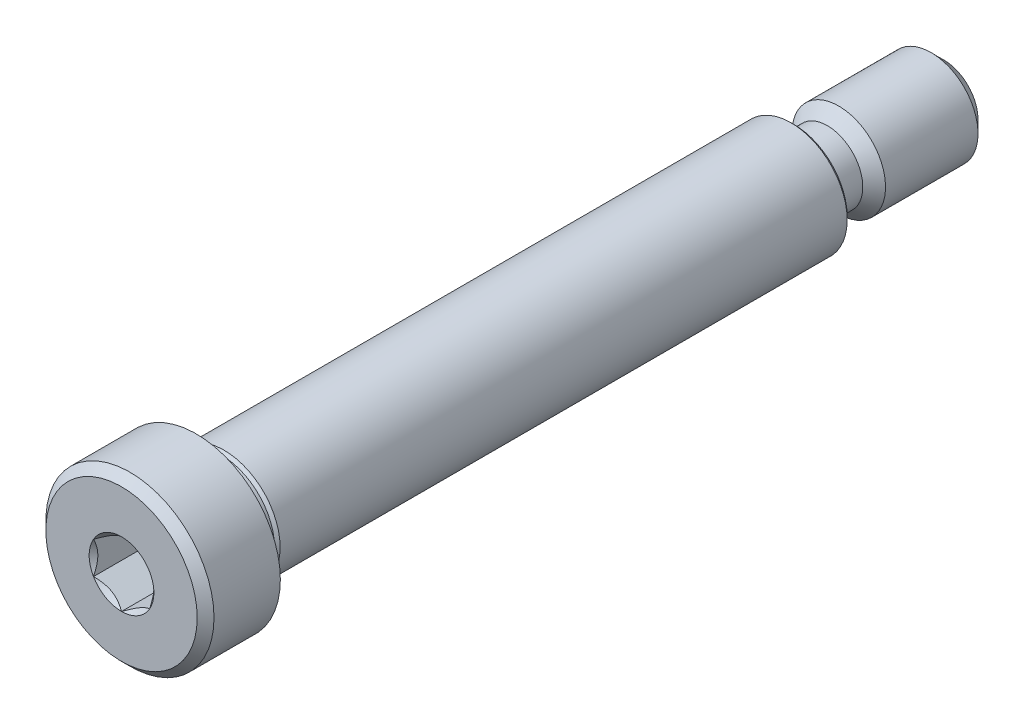
ISO-10303-21;
HEADER;
FILE_DESCRIPTION(('STEP AP214'),'2;1');
FILE_NAME('part.step','',(''),(''),'','','');
FILE_SCHEMA(('AUTOMOTIVE_DESIGN { 1 0 10303 214 1 1 1 1 }'));
ENDSEC;
DATA;
#1=APPLICATION_CONTEXT('core data for automotive mechanical design processes');
#2=APPLICATION_PROTOCOL_DEFINITION('international standard','automotive_design',2000,#1);
#3=PRODUCT_CONTEXT('',#1,'mechanical');
#4=PRODUCT('Part','Part','',(#3));
#5=PRODUCT_RELATED_PRODUCT_CATEGORY('part','',(#4));
#6=PRODUCT_DEFINITION_FORMATION('','',#4);
#7=PRODUCT_DEFINITION_CONTEXT('part definition',#1,'design');
#8=PRODUCT_DEFINITION('design','',#6,#7);
#9=PRODUCT_DEFINITION_SHAPE('','',#8);
#10=(LENGTH_UNIT() NAMED_UNIT(*) SI_UNIT(.MILLI.,.METRE.));
#11=(NAMED_UNIT(*) PLANE_ANGLE_UNIT() SI_UNIT($,.RADIAN.));
#12=(NAMED_UNIT(*) SI_UNIT($,.STERADIAN.) SOLID_ANGLE_UNIT());
#13=UNCERTAINTY_MEASURE_WITH_UNIT(LENGTH_MEASURE(1.E-05),#10,'distance_accuracy_value','');
#14=(GEOMETRIC_REPRESENTATION_CONTEXT(3) GLOBAL_UNCERTAINTY_ASSIGNED_CONTEXT((#13)) GLOBAL_UNIT_ASSIGNED_CONTEXT((#10,
#11,#12)) REPRESENTATION_CONTEXT('',''));
#15=CARTESIAN_POINT('',(0.,0.,0.));
#16=DIRECTION('',(0.,0.,1.));
#17=DIRECTION('',(1.,0.,0.));
#18=AXIS2_PLACEMENT_3D('',#15,#16,#17);
#19=CARTESIAN_POINT('',(0.,6.429375,34.925));
#20=DIRECTION('',(0.,0.,-1.));
#21=DIRECTION('',(-1.,0.,0.));
#22=AXIS2_PLACEMENT_3D('',#19,#20,#21);
#23=PLANE('',#22);
#24=CARTESIAN_POINT('',(0.,0.,34.925));
#25=DIRECTION('',(0.,0.,1.));
#26=DIRECTION('',(1.,0.,0.));
#27=AXIS2_PLACEMENT_3D('',#24,#25,#26);
#28=CIRCLE('',#27,2.74963065701559);
#29=CARTESIAN_POINT('',(-2.38125,1.3748153285078,34.925));
#30=VERTEX_POINT('',#29);
#31=CARTESIAN_POINT('',(-2.38125,-1.3748153285078,34.925));
#32=VERTEX_POINT('',#31);
#33=EDGE_CURVE('E135',#30,#32,#28,.T.);
#34=ORIENTED_EDGE('',*,*,#33,.F.);
#35=CARTESIAN_POINT('',(0.,2.74963065701559,34.925));
#36=VERTEX_POINT('',#35);
#37=EDGE_CURVE('E130',#36,#30,#28,.T.);
#38=ORIENTED_EDGE('',*,*,#37,.F.);
#39=CARTESIAN_POINT('',(2.38125,1.3748153285078,34.925));
#40=VERTEX_POINT('',#39);
#41=EDGE_CURVE('E102',#40,#36,#28,.T.);
#42=ORIENTED_EDGE('',*,*,#41,.F.);
#43=CARTESIAN_POINT('',(2.38125,-1.3748153285078,34.925));
#44=VERTEX_POINT('',#43);
#45=EDGE_CURVE('E92',#44,#40,#28,.T.);
#46=ORIENTED_EDGE('',*,*,#45,.F.);
#47=CARTESIAN_POINT('',(0.,-2.74963065701559,34.925));
#48=VERTEX_POINT('',#47);
#49=EDGE_CURVE('E53',#48,#44,#28,.T.);
#50=ORIENTED_EDGE('',*,*,#49,.F.);
#51=EDGE_CURVE('E60',#32,#48,#28,.T.);
#52=ORIENTED_EDGE('',*,*,#51,.F.);
#53=EDGE_LOOP('',(#34,#38,#42,#46,#50,#52));
#54=FACE_BOUND('',#53,.T.);
#55=CARTESIAN_POINT('',(0.,0.,34.925));
#56=DIRECTION('',(0.,0.,1.));
#57=DIRECTION('',(1.,0.,0.));
#58=AXIS2_PLACEMENT_3D('',#55,#56,#57);
#59=CIRCLE('',#58,6.429375);
#60=CARTESIAN_POINT('',(6.429375,0.,34.925));
#61=VERTEX_POINT('',#60);
#62=EDGE_CURVE('E47',#61,#61,#59,.T.);
#63=ORIENTED_EDGE('',*,*,#62,.T.);
#64=EDGE_LOOP('',(#63));
#65=FACE_BOUND('',#64,.T.);
#66=ADVANCED_FACE('F39',(#54,#65),#23,.F.);
#67=CARTESIAN_POINT('',(0.,0.,34.210625));
#68=DIRECTION('',(0.,0.,-1.));
#69=DIRECTION('',(-1.,0.,0.));
#70=AXIS2_PLACEMENT_3D('',#67,#68,#69);
#71=CONICAL_SURFACE('',#70,7.14375,0.785398163397446);
#72=ORIENTED_EDGE('',*,*,#62,.F.);
#73=EDGE_LOOP('',(#72));
#74=FACE_BOUND('',#73,.T.);
#75=CARTESIAN_POINT('',(0.,0.,34.210625));
#76=DIRECTION('',(0.,0.,1.));
#77=DIRECTION('',(1.,0.,0.));
#78=AXIS2_PLACEMENT_3D('',#75,#76,#77);
#79=CIRCLE('',#78,7.14375);
#80=CARTESIAN_POINT('',(7.14375,0.,34.210625));
#81=VERTEX_POINT('',#80);
#82=EDGE_CURVE('E304',#81,#81,#79,.T.);
#83=ORIENTED_EDGE('',*,*,#82,.T.);
#84=EDGE_LOOP('',(#83));
#85=FACE_BOUND('',#84,.T.);
#86=ADVANCED_FACE('F207',(#74,#85),#71,.T.);
#87=CARTESIAN_POINT('',(0.,0.,34.925));
#88=DIRECTION('',(0.,0.,1.));
#89=DIRECTION('',(1.,0.,0.));
#90=AXIS2_PLACEMENT_3D('',#87,#88,#89);
#91=CYLINDRICAL_SURFACE('',#90,7.14375);
#92=ORIENTED_EDGE('',*,*,#82,.F.);
#93=EDGE_LOOP('',(#92));
#94=FACE_BOUND('',#93,.T.);
#95=CARTESIAN_POINT('',(0.,0.,28.575));
#96=DIRECTION('',(0.,0.,1.));
#97=DIRECTION('',(1.,0.,0.));
#98=AXIS2_PLACEMENT_3D('',#95,#96,#97);
#99=CIRCLE('',#98,7.14375);
#100=CARTESIAN_POINT('',(7.14375,0.,28.575));
#101=VERTEX_POINT('',#100);
#102=EDGE_CURVE('E301',#101,#101,#99,.T.);
#103=ORIENTED_EDGE('',*,*,#102,.T.);
#104=EDGE_LOOP('',(#103));
#105=FACE_BOUND('',#104,.T.);
#106=ADVANCED_FACE('F211',(#94,#105),#91,.T.);
#107=CARTESIAN_POINT('',(0.,7.14375,28.575));
#108=DIRECTION('',(0.,0.,1.));
#109=DIRECTION('',(1.,0.,0.));
#110=AXIS2_PLACEMENT_3D('',#107,#108,#109);
#111=PLANE('',#110);
#112=ORIENTED_EDGE('',*,*,#102,.F.);
#113=EDGE_LOOP('',(#112));
#114=FACE_BOUND('',#113,.T.);
#115=CARTESIAN_POINT('',(0.,0.,28.575));
#116=DIRECTION('',(0.,0.,1.));
#117=DIRECTION('',(1.,0.,0.));
#118=AXIS2_PLACEMENT_3D('',#115,#116,#117);
#119=CIRCLE('',#118,4.7625);
#120=CARTESIAN_POINT('',(4.7625,0.,28.575));
#121=VERTEX_POINT('',#120);
#122=EDGE_CURVE('E298',#121,#121,#119,.T.);
#123=ORIENTED_EDGE('',*,*,#122,.T.);
#124=EDGE_LOOP('',(#123));
#125=FACE_BOUND('',#124,.T.);
#126=ADVANCED_FACE('F216',(#114,#125),#111,.F.);
#127=CARTESIAN_POINT('',(0.,0.,28.336875));
#128=DIRECTION('',(0.,0.,1.));
#129=DIRECTION('',(1.,0.,0.));
#130=AXIS2_PLACEMENT_3D('',#127,#128,#129);
#131=CONICAL_SURFACE('',#130,4.524375,0.785398163397454);
#132=ORIENTED_EDGE('',*,*,#122,.F.);
#133=EDGE_LOOP('',(#132));
#134=FACE_BOUND('',#133,.T.);
#135=CARTESIAN_POINT('',(0.,0.,28.336875));
#136=DIRECTION('',(0.,0.,1.));
#137=DIRECTION('',(1.,0.,0.));
#138=AXIS2_PLACEMENT_3D('',#135,#136,#137);
#139=CIRCLE('',#138,4.524375);
#140=CARTESIAN_POINT('',(4.524375,0.,28.336875));
#141=VERTEX_POINT('',#140);
#142=EDGE_CURVE('E295',#141,#141,#139,.T.);
#143=ORIENTED_EDGE('',*,*,#142,.T.);
#144=EDGE_LOOP('',(#143));
#145=FACE_BOUND('',#144,.T.);
#146=ADVANCED_FACE('F224',(#134,#145),#131,.T.);
#147=CARTESIAN_POINT('',(0.,0.,34.925));
#148=DIRECTION('',(0.,0.,1.));
#149=DIRECTION('',(1.,0.,0.));
#150=AXIS2_PLACEMENT_3D('',#147,#148,#149);
#151=CYLINDRICAL_SURFACE('',#150,4.524375);
#152=ORIENTED_EDGE('',*,*,#142,.F.);
#153=EDGE_LOOP('',(#152));
#154=FACE_BOUND('',#153,.T.);
#155=CARTESIAN_POINT('',(0.,0.,26.450925));
#156=DIRECTION('',(0.,0.,1.));
#157=DIRECTION('',(1.,0.,0.));
#158=AXIS2_PLACEMENT_3D('',#155,#156,#157);
#159=CIRCLE('',#158,4.524375);
#160=CARTESIAN_POINT('',(4.524375,0.,26.450925));
#161=VERTEX_POINT('',#160);
#162=EDGE_CURVE('E292',#161,#161,#159,.T.);
#163=ORIENTED_EDGE('',*,*,#162,.T.);
#164=EDGE_LOOP('',(#163));
#165=FACE_BOUND('',#164,.T.);
#166=ADVANCED_FACE('F228',(#154,#165),#151,.T.);
#167=CARTESIAN_POINT('',(0.,0.,26.2128));
#168=DIRECTION('',(0.,0.,-1.));
#169=DIRECTION('',(-1.,0.,0.));
#170=AXIS2_PLACEMENT_3D('',#167,#168,#169);
#171=CONICAL_SURFACE('',#170,4.7625,0.785398163397468);
#172=ORIENTED_EDGE('',*,*,#162,.F.);
#173=EDGE_LOOP('',(#172));
#174=FACE_BOUND('',#173,.T.);
#175=CARTESIAN_POINT('',(0.,0.,26.2128));
#176=DIRECTION('',(0.,0.,1.));
#177=DIRECTION('',(1.,0.,0.));
#178=AXIS2_PLACEMENT_3D('',#175,#176,#177);
#179=CIRCLE('',#178,4.7625);
#180=CARTESIAN_POINT('',(4.7625,0.,26.2128));
#181=VERTEX_POINT('',#180);
#182=EDGE_CURVE('E289',#181,#181,#179,.T.);
#183=ORIENTED_EDGE('',*,*,#182,.T.);
#184=EDGE_LOOP('',(#183));
#185=FACE_BOUND('',#184,.T.);
#186=ADVANCED_FACE('F232',(#174,#185),#171,.T.);
#187=CARTESIAN_POINT('',(0.,0.,34.925));
#188=DIRECTION('',(0.,0.,1.));
#189=DIRECTION('',(1.,0.,0.));
#190=AXIS2_PLACEMENT_3D('',#187,#188,#189);
#191=CYLINDRICAL_SURFACE('',#190,4.7625);
#192=ORIENTED_EDGE('',*,*,#182,.F.);
#193=EDGE_LOOP('',(#192));
#194=FACE_BOUND('',#193,.T.);
#195=CARTESIAN_POINT('',(0.,0.,-21.9625333333333));
#196=DIRECTION('',(0.,0.,1.));
#197=DIRECTION('',(1.,0.,0.));
#198=AXIS2_PLACEMENT_3D('',#195,#196,#197);
#199=CIRCLE('',#198,4.7625);
#200=CARTESIAN_POINT('',(4.7625,0.,-21.9625333333333));
#201=VERTEX_POINT('',#200);
#202=EDGE_CURVE('E286',#201,#201,#199,.T.);
#203=ORIENTED_EDGE('',*,*,#202,.T.);
#204=EDGE_LOOP('',(#203));
#205=FACE_BOUND('',#204,.T.);
#206=ADVANCED_FACE('F236',(#194,#205),#191,.T.);
#207=CARTESIAN_POINT('',(0.,0.,-22.225));
#208=DIRECTION('',(0.,0.,1.));
#209=DIRECTION('',(1.,0.,0.));
#210=AXIS2_PLACEMENT_3D('',#207,#208,#209);
#211=CONICAL_SURFACE('',#210,4.50003333333333,0.785398163397417);
#212=ORIENTED_EDGE('',*,*,#202,.F.);
#213=EDGE_LOOP('',(#212));
#214=FACE_BOUND('',#213,.T.);
#215=CARTESIAN_POINT('',(0.,0.,-22.225));
#216=DIRECTION('',(0.,0.,1.));
#217=DIRECTION('',(1.,0.,0.));
#218=AXIS2_PLACEMENT_3D('',#215,#216,#217);
#219=CIRCLE('',#218,4.50003333333333);
#220=CARTESIAN_POINT('',(4.50003333333333,0.,-22.225));
#221=VERTEX_POINT('',#220);
#222=EDGE_CURVE('E274',#221,#221,#219,.T.);
#223=ORIENTED_EDGE('',*,*,#222,.T.);
#224=EDGE_LOOP('',(#223));
#225=FACE_BOUND('',#224,.T.);
#226=ADVANCED_FACE('F240',(#214,#225),#211,.T.);
#227=CARTESIAN_POINT('',(0.,4.50003333333333,-22.225));
#228=DIRECTION('',(0.,0.,1.));
#229=DIRECTION('',(1.,0.,0.));
#230=AXIS2_PLACEMENT_3D('',#227,#228,#229);
#231=PLANE('',#230);
#232=CARTESIAN_POINT('',(0.,0.,-22.225));
#233=DIRECTION('',(0.,0.,-1.));
#234=DIRECTION('',(-1.,0.,0.));
#235=AXIS2_PLACEMENT_3D('',#232,#233,#234);
#236=CIRCLE('',#235,3.9751);
#237=CARTESIAN_POINT('',(-3.9751,0.,-22.225));
#238=VERTEX_POINT('',#237);
#239=EDGE_CURVE('E588',#238,#238,#236,.T.);
#240=ORIENTED_EDGE('',*,*,#239,.F.);
#241=EDGE_LOOP('',(#240));
#242=FACE_BOUND('',#241,.T.);
#243=ORIENTED_EDGE('',*,*,#222,.F.);
#244=EDGE_LOOP('',(#243));
#245=FACE_BOUND('',#244,.T.);
#246=ADVANCED_FACE('F244',(#242,#245),#231,.F.);
#247=CARTESIAN_POINT('',(0.,0.,34.925));
#248=DIRECTION('',(0.,0.,1.));
#249=DIRECTION('',(1.,0.,0.));
#250=AXIS2_PLACEMENT_3D('',#247,#248,#249);
#251=CONICAL_SURFACE('',#250,2.74963065701559,0.78539816339745);
#252=ORIENTED_EDGE('',*,*,#41,.T.);
#253=CARTESIAN_POINT('',(2.38145,1.37469985845396,34.9251154773272));
#254=CARTESIAN_POINT('',(2.29959321762095,1.4219598937955,34.8778948967095));
#255=CARTESIAN_POINT('',(2.21636766622824,1.47001018829554,34.8334475752929));
#256=CARTESIAN_POINT('',(2.04666151916196,1.56799007798739,34.7520654569856));
#257=CARTESIAN_POINT('',(1.9601647826469,1.61792899209839,34.7151759430951));
#258=CARTESIAN_POINT('',(1.78574822599096,1.71862843803482,34.6519834131659));
#259=CARTESIAN_POINT('',(1.69787282881932,1.76936332224701,34.6255215587295));
#260=CARTESIAN_POINT('',(1.52018740592912,1.87195004898374,34.5847515156161));
#261=CARTESIAN_POINT('',(1.43038280881413,1.92379875730254,34.5704128915305));
#262=CARTESIAN_POINT('',(1.27561039686966,2.01315665100181,34.5574757847701));
#263=CARTESIAN_POINT('',(1.21084255103038,2.05055038423195,34.5555606046532));
#264=CARTESIAN_POINT('',(1.08141272066442,2.1252767316349,34.5587866227677));
#265=CARTESIAN_POINT('',(1.01675078120664,2.16260931978718,34.5639302948571));
#266=CARTESIAN_POINT('',(0.888037451422602,2.23692199538629,34.5809813108716));
#267=CARTESIAN_POINT('',(0.823986825765144,2.27390164135138,34.5928962213493));
#268=CARTESIAN_POINT('',(0.696993161094725,2.34722146783423,34.622835672352));
#269=CARTESIAN_POINT('',(0.634050037564174,2.38356169714823,34.6408597445185));
#270=CARTESIAN_POINT('',(0.472823849267817,2.47664568036155,34.6943688075524));
#271=CARTESIAN_POINT('',(0.375540508712158,2.53281224321902,34.7338874208722));
#272=CARTESIAN_POINT('',(0.232493937374429,2.61540021968751,34.8006003435508));
#273=CARTESIAN_POINT('',(0.185353711056035,2.6426166420421,34.8240402091113));
#274=CARTESIAN_POINT('',(0.091946473633363,2.69654533571234,34.8730566766595));
#275=CARTESIAN_POINT('',(0.0456789475031802,2.72325790437833,34.8986319667669));
#276=CARTESIAN_POINT('',(-0.000199999999998552,2.74974612706943,34.9251154773272));
#277=B_SPLINE_CURVE_WITH_KNOTS('',3,(#253,#254,#255,#256,#257,#258,#259,#260,#261,#262,#263,
#264,#265,#266,#267,#268,#269,#270,#271,#272,#273,#274,#275,#276),.UNSPECIFIED.,.F.,.F.,(4,2,2,
2,2,2,2,2,2,2,2,4),(0.,0.317196610611951,0.636241461041219,0.950218950629223,1.26340583824126,
1.48752413747844,1.71172100167747,1.93616888974082,2.16059957440836,2.51709639744763,
2.69486147369099,2.87251813383153),.UNSPECIFIED.);
#278=EDGE_CURVE('E11',#40,#36,#277,.T.);
#279=ORIENTED_EDGE('',*,*,#278,.F.);
#280=EDGE_LOOP('',(#252,#279));
#281=FACE_BOUND('',#280,.T.);
#282=ADVANCED_FACE('F105',(#281),#251,.F.);
#283=ORIENTED_EDGE('',*,*,#37,.T.);
#284=CARTESIAN_POINT('',(0.000199999999999747,2.74974612706943,34.9251154773272));
#285=CARTESIAN_POINT('',(-0.08165678237905,2.70248609172789,34.8778948967095));
#286=CARTESIAN_POINT('',(-0.16488233377176,2.65443579722785,34.8334475752929));
#287=CARTESIAN_POINT('',(-0.33458848083804,2.556455907536,34.7520654569856));
#288=CARTESIAN_POINT('',(-0.421085217353103,2.50651699342501,34.7151759430951));
#289=CARTESIAN_POINT('',(-0.595501774009043,2.40581754748857,34.6519834131659));
#290=CARTESIAN_POINT('',(-0.683377171180675,2.35508266327639,34.6255215587295));
#291=CARTESIAN_POINT('',(-0.861062594070875,2.25249593653966,34.5847515156161));
#292=CARTESIAN_POINT('',(-0.95086719118587,2.20064722822085,34.5704128915305));
#293=CARTESIAN_POINT('',(-1.10563960313034,2.11128933452158,34.5574757847701));
#294=CARTESIAN_POINT('',(-1.17040744896962,2.07389560129144,34.5555606046532));
#295=CARTESIAN_POINT('',(-1.29983727933557,1.99916925388849,34.5587866227677));
#296=CARTESIAN_POINT('',(-1.36449921879335,1.96183666573622,34.5639302948571));
#297=CARTESIAN_POINT('',(-1.49321254857739,1.88752399013711,34.5809813108716));
#298=CARTESIAN_POINT('',(-1.55726317423485,1.85054434417201,34.5928962213493));
#299=CARTESIAN_POINT('',(-1.68425683890527,1.77722451768917,34.622835672352));
#300=CARTESIAN_POINT('',(-1.74719996243582,1.74088428837517,34.6408597445185));
#301=CARTESIAN_POINT('',(-1.90842615073218,1.64780030516185,34.6943688075524));
#302=CARTESIAN_POINT('',(-2.00570949128784,1.59163374230437,34.7338874208722));
#303=CARTESIAN_POINT('',(-2.14875606262557,1.50904576583588,34.8006003435508));
#304=CARTESIAN_POINT('',(-2.19589628894397,1.48182934348129,34.8240402091113));
#305=CARTESIAN_POINT('',(-2.28930352636664,1.42790064981105,34.8730566766595));
#306=CARTESIAN_POINT('',(-2.33557105249682,1.40118808114505,34.8986319667669));
#307=CARTESIAN_POINT('',(-2.38145,1.37469985845396,34.9251154773272));
#308=B_SPLINE_CURVE_WITH_KNOTS('',3,(#284,#285,#286,#287,#288,#289,#290,#291,#292,#293,#294,
#295,#296,#297,#298,#299,#300,#301,#302,#303,#304,#305,#306,#307),.UNSPECIFIED.,.F.,.F.,(4,2,2,
2,2,2,2,2,2,2,2,4),(0.,0.317196610611948,0.636241461041218,0.950218950629222,1.26340583824126,
1.48752413747844,1.71172100167747,1.93616888974082,2.16059957440836,2.51709639744763,
2.69486147369099,2.87251813383154),.UNSPECIFIED.);
#309=EDGE_CURVE('E131',#36,#30,#308,.T.);
#310=ORIENTED_EDGE('',*,*,#309,.F.);
#311=EDGE_LOOP('',(#283,#310));
#312=FACE_BOUND('',#311,.T.);
#313=ADVANCED_FACE('F337',(#312),#251,.F.);
#314=ORIENTED_EDGE('',*,*,#33,.T.);
#315=CARTESIAN_POINT('',(-2.38125,-2.74194290589387,35.8069808945799));
#316=CARTESIAN_POINT('',(-2.38125,-2.67517961056039,35.7565846679781));
#317=CARTESIAN_POINT('',(-2.38125,-2.60804251112752,35.7066755875907));
#318=CARTESIAN_POINT('',(-2.38125,-2.47287325055307,35.6080498309857));
#319=CARTESIAN_POINT('',(-2.38125,-2.40484086895313,35.5593334572448));
#320=CARTESIAN_POINT('',(-2.38125,-2.26723593505441,35.4629648544534));
#321=CARTESIAN_POINT('',(-2.38125,-2.19765553346049,35.4153237954326));
#322=CARTESIAN_POINT('',(-2.38125,-2.05731367842203,35.3218199233866));
#323=CARTESIAN_POINT('',(-2.38125,-1.98655230892573,35.2759569847287));
#324=CARTESIAN_POINT('',(-2.38125,-1.83957751909226,35.1838459007133));
#325=CARTESIAN_POINT('',(-2.38125,-1.76328361992075,35.1377255173928));
#326=CARTESIAN_POINT('',(-2.38125,-1.6089135770446,35.0485183038905));
#327=CARTESIAN_POINT('',(-2.38125,-1.53083712149137,35.0054320099754));
#328=CARTESIAN_POINT('',(-2.38125,-1.37291620334514,34.9232265014712));
#329=CARTESIAN_POINT('',(-2.38125,-1.29307799938228,34.8840953578519));
#330=CARTESIAN_POINT('',(-2.38125,-1.13121425093132,34.8106679503152));
#331=CARTESIAN_POINT('',(-2.38125,-1.04918943681795,34.7763700954538));
#332=CARTESIAN_POINT('',(-2.38125,-0.889535256759271,34.7163546314156));
#333=CARTESIAN_POINT('',(-2.38125,-0.812083865770258,34.690168478432));
#334=CARTESIAN_POINT('',(-2.38125,-0.655316366527662,34.6440097514868));
#335=CARTESIAN_POINT('',(-2.38125,-0.57600013021683,34.6240376055837));
#336=CARTESIAN_POINT('',(-2.38125,-0.417295761573375,34.5916821452488));
#337=CARTESIAN_POINT('',(-2.38125,-0.337934576883846,34.5791688083547));
#338=CARTESIAN_POINT('',(-2.38125,-0.178363852969583,34.5619738601659));
#339=CARTESIAN_POINT('',(-2.38125,-0.0981544619617662,34.5572909026126));
#340=CARTESIAN_POINT('',(-2.38125,0.0594188034321302,34.5561044408392));
#341=CARTESIAN_POINT('',(-2.38125,0.136780588525994,34.5593110105046));
#342=CARTESIAN_POINT('',(-2.38125,0.29084096060734,34.5730870567428));
#343=CARTESIAN_POINT('',(-2.38125,0.36753948243541,34.5836572485871));
#344=CARTESIAN_POINT('',(-2.38125,0.521017492835389,34.6117628298525));
#345=CARTESIAN_POINT('',(-2.38125,0.597774958394049,34.6294167489314));
#346=CARTESIAN_POINT('',(-2.38125,0.74960981425701,34.6707513962434));
#347=CARTESIAN_POINT('',(-2.38125,0.824687344568028,34.6944316201904));
#348=CARTESIAN_POINT('',(-2.38125,1.06107814410025,34.777894862956));
#349=CARTESIAN_POINT('',(-2.38125,1.2190478622181,34.8471839270396));
#350=CARTESIAN_POINT('',(-2.38125,1.45021000267342,34.9626640838597));
#351=CARTESIAN_POINT('',(-2.38125,1.52644290442585,35.0031730572583));
#352=CARTESIAN_POINT('',(-2.38125,1.67717618538172,35.0873026892371));
#353=CARTESIAN_POINT('',(-2.38125,1.7516768735884,35.1309227870999));
#354=CARTESIAN_POINT('',(-2.38125,1.89548152088328,35.218412556489));
#355=CARTESIAN_POINT('',(-2.38125,1.96485959608998,35.2621617927418));
#356=CARTESIAN_POINT('',(-2.38125,2.10242624411169,35.3515011587306));
#357=CARTESIAN_POINT('',(-2.38125,2.17061472626633,35.397091427904));
#358=CARTESIAN_POINT('',(-2.38125,2.30540317317354,35.4894060050932));
#359=CARTESIAN_POINT('',(-2.38125,2.37201154222166,35.5361180928962));
#360=CARTESIAN_POINT('',(-2.38125,2.50431800054459,35.6307775780183));
#361=CARTESIAN_POINT('',(-2.38125,2.57001633510792,35.6787246320963));
#362=CARTESIAN_POINT('',(-2.38125,2.63533378855947,35.7271767335425));
#363=B_SPLINE_CURVE_WITH_KNOTS('',3,(#315,#316,#317,#318,#319,#320,#321,#322,#323,#324,#325,
#326,#327,#328,#329,#330,#331,#332,#333,#334,#335,#336,#337,#338,#339,#340,#341,#342,#343,#344,
#345,#346,#347,#348,#349,#350,#351,#352,#353,#354,#355,#356,#357,#358,#359,#360,#361,#362),
.UNSPECIFIED.,.F.,.F.,(4,2,2,2,2,2,2,2,2,2,2,2,2,2,2,2,2,2,2,2,2,2,2,4),(0.,0.250951284009982,
0.50196556482788,0.754924775973582,1.00786608164542,1.27526207798892,1.54270521780082,
1.80931602029339,2.07583885812519,2.32089852590464,2.56597507114535,2.80664400307698,
3.04727155311265,3.27918940971451,3.51112979698762,3.74712477407482,3.98310000940112,
4.49898139184705,4.75794323931354,5.01685853149448,5.26288960015361,5.50893933794672,
5.75299038397142,5.9969743162797),.UNSPECIFIED.);
#364=EDGE_CURVE('E133',#30,#32,#363,.F.);
#365=ORIENTED_EDGE('',*,*,#364,.F.);
#366=EDGE_LOOP('',(#314,#365));
#367=FACE_BOUND('',#366,.T.);
#368=ADVANCED_FACE('F330',(#367),#251,.F.);
#369=ORIENTED_EDGE('',*,*,#51,.T.);
#370=CARTESIAN_POINT('',(-2.38145,-1.37469985845396,34.9251154773272));
#371=CARTESIAN_POINT('',(-2.29959321762095,-1.4219598937955,34.8778948967095));
#372=CARTESIAN_POINT('',(-2.21636766622824,-1.47001018829554,34.8334475752929));
#373=CARTESIAN_POINT('',(-2.04666151916196,-1.56799007798739,34.7520654569856));
#374=CARTESIAN_POINT('',(-1.9601647826469,-1.61792899209838,34.7151759430951));
#375=CARTESIAN_POINT('',(-1.78574822599096,-1.71862843803482,34.6519834131659));
#376=CARTESIAN_POINT('',(-1.69787282881933,-1.769363322247,34.6255215587295));
#377=CARTESIAN_POINT('',(-1.52018740592913,-1.87195004898373,34.5847515156161));
#378=CARTESIAN_POINT('',(-1.43038280881413,-1.92379875730254,34.5704128915305));
#379=CARTESIAN_POINT('',(-1.27561039686966,-2.01315665100181,34.5574757847701));
#380=CARTESIAN_POINT('',(-1.21084255103039,-2.05055038423195,34.5555606046532));
#381=CARTESIAN_POINT('',(-1.08141272066443,-2.1252767316349,34.5587866227677));
#382=CARTESIAN_POINT('',(-1.01675078120665,-2.16260931978717,34.5639302948571));
#383=CARTESIAN_POINT('',(-0.888037451422606,-2.23692199538628,34.5809813108716));
#384=CARTESIAN_POINT('',(-0.823986825765148,-2.27390164135138,34.5928962213493));
#385=CARTESIAN_POINT('',(-0.696993161094729,-2.34722146783422,34.622835672352));
#386=CARTESIAN_POINT('',(-0.634050037564179,-2.38356169714822,34.6408597445185));
#387=CARTESIAN_POINT('',(-0.472823849267822,-2.47664568036154,34.6943688075524));
#388=CARTESIAN_POINT('',(-0.375540508712162,-2.53281224321902,34.7338874208722));
#389=CARTESIAN_POINT('',(-0.232493937374432,-2.61540021968751,34.8006003435508));
#390=CARTESIAN_POINT('',(-0.185353711056037,-2.64261664204209,34.8240402091113));
#391=CARTESIAN_POINT('',(-0.0919464736333625,-2.69654533571233,34.8730566766595));
#392=CARTESIAN_POINT('',(-0.0456789475031788,-2.72325790437833,34.8986319667669));
#393=CARTESIAN_POINT('',(0.00020000000000081,-2.74974612706943,34.9251154773272));
#394=B_SPLINE_CURVE_WITH_KNOTS('',3,(#370,#371,#372,#373,#374,#375,#376,#377,#378,#379,#380,
#381,#382,#383,#384,#385,#386,#387,#388,#389,#390,#391,#392,#393),.UNSPECIFIED.,.F.,.F.,(4,2,2,
2,2,2,2,2,2,2,2,4),(0.,0.31719661061195,0.636241461041217,0.95021895062922,1.26340583824126,
1.48752413747844,1.71172100167747,1.93616888974082,2.16059957440836,2.51709639744763,
2.69486147369099,2.87251813383154),.UNSPECIFIED.);
#395=EDGE_CURVE('E173',#32,#48,#394,.T.);
#396=ORIENTED_EDGE('',*,*,#395,.F.);
#397=EDGE_LOOP('',(#369,#396));
#398=FACE_BOUND('',#397,.T.);
#399=ADVANCED_FACE('F331',(#398),#251,.F.);
#400=ORIENTED_EDGE('',*,*,#49,.T.);
#401=CARTESIAN_POINT('',(-0.000200000000000139,-2.74974612706943,34.9251154773272));
#402=CARTESIAN_POINT('',(0.0816567823790498,-2.70248609172789,34.8778948967095));
#403=CARTESIAN_POINT('',(0.16488233377176,-2.65443579722785,34.8334475752929));
#404=CARTESIAN_POINT('',(0.334588480838041,-2.556455907536,34.7520654569856));
#405=CARTESIAN_POINT('',(0.421085217353104,-2.50651699342501,34.7151759430951));
#406=CARTESIAN_POINT('',(0.595501774009045,-2.40581754748857,34.6519834131659));
#407=CARTESIAN_POINT('',(0.683377171180677,-2.35508266327638,34.6255215587295));
#408=CARTESIAN_POINT('',(0.861062594070879,-2.25249593653965,34.5847515156161));
#409=CARTESIAN_POINT('',(0.950867191185875,-2.20064722822084,34.5704128915305));
#410=CARTESIAN_POINT('',(1.10563960313035,-2.11128933452158,34.5574757847701));
#411=CARTESIAN_POINT('',(1.17040744896962,-2.07389560129144,34.5555606046532));
#412=CARTESIAN_POINT('',(1.29983727933558,-1.99916925388849,34.5587866227677));
#413=CARTESIAN_POINT('',(1.36449921879336,-1.96183666573621,34.5639302948571));
#414=CARTESIAN_POINT('',(1.4932125485774,-1.8875239901371,34.5809813108716));
#415=CARTESIAN_POINT('',(1.55726317423486,-1.85054434417201,34.5928962213493));
#416=CARTESIAN_POINT('',(1.68425683890528,-1.77722451768916,34.622835672352));
#417=CARTESIAN_POINT('',(1.74719996243583,-1.74088428837516,34.6408597445185));
#418=CARTESIAN_POINT('',(1.90842615073219,-1.64780030516185,34.6943688075524));
#419=CARTESIAN_POINT('',(2.00570949128784,-1.59163374230437,34.7338874208722));
#420=CARTESIAN_POINT('',(2.14875606262557,-1.50904576583588,34.8006003435508));
#421=CARTESIAN_POINT('',(2.19589628894397,-1.48182934348129,34.8240402091113));
#422=CARTESIAN_POINT('',(2.28930352636664,-1.42790064981105,34.8730566766595));
#423=CARTESIAN_POINT('',(2.33557105249682,-1.40118808114506,34.8986319667669));
#424=CARTESIAN_POINT('',(2.38145,-1.37469985845396,34.9251154773272));
#425=B_SPLINE_CURVE_WITH_KNOTS('',3,(#401,#402,#403,#404,#405,#406,#407,#408,#409,#410,#411,
#412,#413,#414,#415,#416,#417,#418,#419,#420,#421,#422,#423,#424),.UNSPECIFIED.,.F.,.F.,(4,2,2,
2,2,2,2,2,2,2,2,4),(0.,0.317196610611949,0.63624146104122,0.950218950629226,1.26340583824126,
1.48752413747844,1.71172100167747,1.93616888974082,2.16059957440837,2.51709639744763,
2.69486147369099,2.87251813383154),.UNSPECIFIED.);
#426=EDGE_CURVE('E117',#48,#44,#425,.T.);
#427=ORIENTED_EDGE('',*,*,#426,.F.);
#428=EDGE_LOOP('',(#400,#427));
#429=FACE_BOUND('',#428,.T.);
#430=ADVANCED_FACE('F159',(#429),#251,.F.);
#431=ORIENTED_EDGE('',*,*,#45,.T.);
#432=CARTESIAN_POINT('',(2.38125,-2.74194290589387,35.8069808945799));
#433=CARTESIAN_POINT('',(2.38125,-2.6751796105604,35.7565846679781));
#434=CARTESIAN_POINT('',(2.38125,-2.60804251112752,35.7066755875907));
#435=CARTESIAN_POINT('',(2.38125,-2.47287325055307,35.6080498309857));
#436=CARTESIAN_POINT('',(2.38125,-2.40484086895312,35.5593334572448));
#437=CARTESIAN_POINT('',(2.38125,-2.26723593505441,35.4629648544534));
#438=CARTESIAN_POINT('',(2.38125,-2.19765553346049,35.4153237954326));
#439=CARTESIAN_POINT('',(2.38125,-2.05731367842203,35.3218199233866));
#440=CARTESIAN_POINT('',(2.38125,-1.98655230892573,35.2759569847287));
#441=CARTESIAN_POINT('',(2.38125,-1.83957751909225,35.1838459007133));
#442=CARTESIAN_POINT('',(2.38125,-1.76328361992075,35.1377255173928));
#443=CARTESIAN_POINT('',(2.38125,-1.60891357704459,35.0485183038905));
#444=CARTESIAN_POINT('',(2.38125,-1.53083712149136,35.0054320099754));
#445=CARTESIAN_POINT('',(2.38125,-1.37291620334514,34.9232265014712));
#446=CARTESIAN_POINT('',(2.38125,-1.29307799938228,34.8840953578519));
#447=CARTESIAN_POINT('',(2.38125,-1.13121425093132,34.8106679503151));
#448=CARTESIAN_POINT('',(2.38125,-1.04918943681795,34.7763700954537));
#449=CARTESIAN_POINT('',(2.38125,-0.889535256759271,34.7163546314156));
#450=CARTESIAN_POINT('',(2.38125,-0.812083865770258,34.690168478432));
#451=CARTESIAN_POINT('',(2.38125,-0.655316366527662,34.6440097514868));
#452=CARTESIAN_POINT('',(2.38125,-0.576000130216831,34.6240376055837));
#453=CARTESIAN_POINT('',(2.38125,-0.417295761573376,34.5916821452488));
#454=CARTESIAN_POINT('',(2.38125,-0.337934576883848,34.5791688083547));
#455=CARTESIAN_POINT('',(2.38125,-0.178363852969584,34.5619738601659));
#456=CARTESIAN_POINT('',(2.38125,-0.0981544619617677,34.5572909026126));
#457=CARTESIAN_POINT('',(2.38125,0.0594188034321287,34.5561044408392));
#458=CARTESIAN_POINT('',(2.38125,0.136780588525993,34.5593110105046));
#459=CARTESIAN_POINT('',(2.38125,0.290840960607339,34.5730870567428));
#460=CARTESIAN_POINT('',(2.38125,0.367539482435409,34.5836572485871));
#461=CARTESIAN_POINT('',(2.38125,0.521017492835389,34.6117628298525));
#462=CARTESIAN_POINT('',(2.38125,0.597774958394049,34.6294167489314));
#463=CARTESIAN_POINT('',(2.38125,0.74960981425701,34.6707513962434));
#464=CARTESIAN_POINT('',(2.38125,0.824687344568027,34.6944316201904));
#465=CARTESIAN_POINT('',(2.38125,1.06107814410025,34.777894862956));
#466=CARTESIAN_POINT('',(2.38125,1.2190478622181,34.8471839270396));
#467=CARTESIAN_POINT('',(2.38125,1.45021000267342,34.9626640838597));
#468=CARTESIAN_POINT('',(2.38125,1.52644290442585,35.0031730572583));
#469=CARTESIAN_POINT('',(2.38125,1.67717618538173,35.0873026892371));
#470=CARTESIAN_POINT('',(2.38125,1.7516768735884,35.1309227870999));
#471=CARTESIAN_POINT('',(2.38125,1.89548152088328,35.218412556489));
#472=CARTESIAN_POINT('',(2.38125,1.96485959608998,35.2621617927418));
#473=CARTESIAN_POINT('',(2.38125,2.10242624411169,35.3515011587306));
#474=CARTESIAN_POINT('',(2.38125,2.17061472626633,35.397091427904));
#475=CARTESIAN_POINT('',(2.38125,2.30540317317354,35.4894060050932));
#476=CARTESIAN_POINT('',(2.38125,2.37201154222167,35.5361180928962));
#477=CARTESIAN_POINT('',(2.38125,2.50431800054459,35.6307775780183));
#478=CARTESIAN_POINT('',(2.38125,2.57001633510792,35.6787246320963));
#479=CARTESIAN_POINT('',(2.38125,2.63533378855947,35.7271767335425));
#480=B_SPLINE_CURVE_WITH_KNOTS('',3,(#432,#433,#434,#435,#436,#437,#438,#439,#440,#441,#442,
#443,#444,#445,#446,#447,#448,#449,#450,#451,#452,#453,#454,#455,#456,#457,#458,#459,#460,#461,
#462,#463,#464,#465,#466,#467,#468,#469,#470,#471,#472,#473,#474,#475,#476,#477,#478,#479),
.UNSPECIFIED.,.F.,.F.,(4,2,2,2,2,2,2,2,2,2,2,2,2,2,2,2,2,2,2,2,2,2,2,4),(0.,0.250951284009989,
0.501965564827885,0.754924775973593,1.00786608164543,1.27526207798892,1.54270521780083,
1.8093160202934,2.0758388581252,2.32089852590464,2.56597507114536,2.80664400307698,
3.04727155311265,3.27918940971451,3.51112979698762,3.74712477407483,3.98310000940112,
4.49898139184705,4.75794323931354,5.01685853149448,5.26288960015361,5.50893933794672,
5.75299038397142,5.99697431627971),.UNSPECIFIED.);
#481=EDGE_CURVE('E96',#44,#40,#480,.T.);
#482=ORIENTED_EDGE('',*,*,#481,.F.);
#483=EDGE_LOOP('',(#431,#482));
#484=FACE_BOUND('',#483,.T.);
#485=ADVANCED_FACE('F94',(#484),#251,.F.);
#486=CARTESIAN_POINT('',(0.,0.,30.1625));
#487=DIRECTION('',(0.,0.,1.));
#488=DIRECTION('',(1.,0.,0.));
#489=AXIS2_PLACEMENT_3D('',#486,#487,#488);
#490=PLANE('',#489);
#491=DIRECTION('',(0.,1.,0.));
#492=VECTOR('',#491,1.);
#493=CARTESIAN_POINT('',(2.38125,-1.3748153285078,30.1625));
#494=LINE('',#493,#492);
#495=CARTESIAN_POINT('',(2.38125,-1.3748153285078,30.1625));
#496=VERTEX_POINT('',#495);
#497=CARTESIAN_POINT('',(2.38125,1.3748153285078,30.1625));
#498=VERTEX_POINT('',#497);
#499=EDGE_CURVE('E116',#496,#498,#494,.T.);
#500=ORIENTED_EDGE('',*,*,#499,.T.);
#501=DIRECTION('',(-0.866025403784439,0.5,0.));
#502=VECTOR('',#501,1.);
#503=CARTESIAN_POINT('',(2.38125,1.3748153285078,30.1625));
#504=LINE('',#503,#502);
#505=CARTESIAN_POINT('',(0.,2.74963065701559,30.1625));
#506=VERTEX_POINT('',#505);
#507=EDGE_CURVE('E121',#498,#506,#504,.T.);
#508=ORIENTED_EDGE('',*,*,#507,.T.);
#509=DIRECTION('',(-0.866025403784439,-0.5,0.));
#510=VECTOR('',#509,1.);
#511=CARTESIAN_POINT('',(0.,2.74963065701559,30.1625));
#512=LINE('',#511,#510);
#513=CARTESIAN_POINT('',(-2.38125,1.3748153285078,30.1625));
#514=VERTEX_POINT('',#513);
#515=EDGE_CURVE('E263',#506,#514,#512,.T.);
#516=ORIENTED_EDGE('',*,*,#515,.T.);
#517=DIRECTION('',(0.,-1.,0.));
#518=VECTOR('',#517,1.);
#519=CARTESIAN_POINT('',(-2.38125,1.3748153285078,30.1625));
#520=LINE('',#519,#518);
#521=CARTESIAN_POINT('',(-2.38125,-1.3748153285078,30.1625));
#522=VERTEX_POINT('',#521);
#523=EDGE_CURVE('E267',#514,#522,#520,.T.);
#524=ORIENTED_EDGE('',*,*,#523,.T.);
#525=DIRECTION('',(0.866025403784439,-0.5,0.));
#526=VECTOR('',#525,1.);
#527=CARTESIAN_POINT('',(-2.38125,-1.3748153285078,30.1625));
#528=LINE('',#527,#526);
#529=CARTESIAN_POINT('',(0.,-2.74963065701559,30.1625));
#530=VERTEX_POINT('',#529);
#531=EDGE_CURVE('E270',#522,#530,#528,.T.);
#532=ORIENTED_EDGE('',*,*,#531,.T.);
#533=DIRECTION('',(0.866025403784439,0.5,0.));
#534=VECTOR('',#533,1.);
#535=CARTESIAN_POINT('',(0.,-2.74963065701559,30.1625));
#536=LINE('',#535,#534);
#537=EDGE_CURVE('E124',#530,#496,#536,.T.);
#538=ORIENTED_EDGE('',*,*,#537,.T.);
#539=EDGE_LOOP('',(#500,#508,#516,#524,#532,#538));
#540=FACE_BOUND('',#539,.T.);
#541=ADVANCED_FACE('F158',(#540),#490,.T.);
#542=CARTESIAN_POINT('',(2.38125,1.3748153285078,30.1625));
#543=DIRECTION('',(0.5,0.866025403784439,0.));
#544=DIRECTION('',(-0.866025403784439,0.5,0.));
#545=AXIS2_PLACEMENT_3D('',#542,#543,#544);
#546=PLANE('',#545);
#547=DIRECTION('',(0.,0.,1.));
#548=VECTOR('',#547,1.);
#549=CARTESIAN_POINT('',(2.38125,1.3748153285078,30.1625));
#550=LINE('',#549,#548);
#551=EDGE_CURVE('E113',#498,#40,#550,.T.);
#552=ORIENTED_EDGE('',*,*,#551,.T.);
#553=ORIENTED_EDGE('',*,*,#278,.T.);
#554=DIRECTION('',(0.,0.,1.));
#555=VECTOR('',#554,1.);
#556=CARTESIAN_POINT('',(0.,2.74963065701559,30.1625));
#557=LINE('',#556,#555);
#558=EDGE_CURVE('E123',#506,#36,#557,.T.);
#559=ORIENTED_EDGE('',*,*,#558,.F.);
#560=ORIENTED_EDGE('',*,*,#507,.F.);
#561=EDGE_LOOP('',(#552,#553,#559,#560));
#562=FACE_BOUND('',#561,.T.);
#563=ADVANCED_FACE('F119',(#562),#546,.F.);
#564=CARTESIAN_POINT('',(0.,2.74963065701559,30.1625));
#565=DIRECTION('',(-0.5,0.866025403784439,0.));
#566=DIRECTION('',(-0.866025403784439,-0.5,0.));
#567=AXIS2_PLACEMENT_3D('',#564,#565,#566);
#568=PLANE('',#567);
#569=ORIENTED_EDGE('',*,*,#558,.T.);
#570=ORIENTED_EDGE('',*,*,#309,.T.);
#571=DIRECTION('',(0.,0.,1.));
#572=VECTOR('',#571,1.);
#573=CARTESIAN_POINT('',(-2.38125,1.3748153285078,30.1625));
#574=LINE('',#573,#572);
#575=EDGE_CURVE('E281',#514,#30,#574,.T.);
#576=ORIENTED_EDGE('',*,*,#575,.F.);
#577=ORIENTED_EDGE('',*,*,#515,.F.);
#578=EDGE_LOOP('',(#569,#570,#576,#577));
#579=FACE_BOUND('',#578,.T.);
#580=ADVANCED_FACE('F151',(#579),#568,.F.);
#581=CARTESIAN_POINT('',(-2.38125,1.3748153285078,30.1625));
#582=DIRECTION('',(-1.,0.,0.));
#583=DIRECTION('',(0.,0.,1.));
#584=AXIS2_PLACEMENT_3D('',#581,#582,#583);
#585=PLANE('',#584);
#586=ORIENTED_EDGE('',*,*,#575,.T.);
#587=ORIENTED_EDGE('',*,*,#364,.T.);
#588=DIRECTION('',(0.,0.,1.));
#589=VECTOR('',#588,1.);
#590=CARTESIAN_POINT('',(-2.38125,-1.3748153285078,30.1625));
#591=LINE('',#590,#589);
#592=EDGE_CURVE('E278',#522,#32,#591,.T.);
#593=ORIENTED_EDGE('',*,*,#592,.F.);
#594=ORIENTED_EDGE('',*,*,#523,.F.);
#595=EDGE_LOOP('',(#586,#587,#593,#594));
#596=FACE_BOUND('',#595,.T.);
#597=ADVANCED_FACE('F197',(#596),#585,.F.);
#598=CARTESIAN_POINT('',(-2.38125,-1.3748153285078,30.1625));
#599=DIRECTION('',(-0.5,-0.866025403784439,0.));
#600=DIRECTION('',(0.866025403784439,-0.5,0.));
#601=AXIS2_PLACEMENT_3D('',#598,#599,#600);
#602=PLANE('',#601);
#603=ORIENTED_EDGE('',*,*,#592,.T.);
#604=ORIENTED_EDGE('',*,*,#395,.T.);
#605=DIRECTION('',(0.,0.,1.));
#606=VECTOR('',#605,1.);
#607=CARTESIAN_POINT('',(0.,-2.74963065701559,30.1625));
#608=LINE('',#607,#606);
#609=EDGE_CURVE('E275',#530,#48,#608,.T.);
#610=ORIENTED_EDGE('',*,*,#609,.F.);
#611=ORIENTED_EDGE('',*,*,#531,.F.);
#612=EDGE_LOOP('',(#603,#604,#610,#611));
#613=FACE_BOUND('',#612,.T.);
#614=ADVANCED_FACE('F193',(#613),#602,.F.);
#615=CARTESIAN_POINT('',(0.,-2.74963065701559,30.1625));
#616=DIRECTION('',(0.5,-0.866025403784439,0.));
#617=DIRECTION('',(0.866025403784439,0.5,0.));
#618=AXIS2_PLACEMENT_3D('',#615,#616,#617);
#619=PLANE('',#618);
#620=ORIENTED_EDGE('',*,*,#609,.T.);
#621=ORIENTED_EDGE('',*,*,#426,.T.);
#622=DIRECTION('',(0.,0.,1.));
#623=VECTOR('',#622,1.);
#624=CARTESIAN_POINT('',(2.38125,-1.3748153285078,30.1625));
#625=LINE('',#624,#623);
#626=EDGE_CURVE('E115',#496,#44,#625,.T.);
#627=ORIENTED_EDGE('',*,*,#626,.F.);
#628=ORIENTED_EDGE('',*,*,#537,.F.);
#629=EDGE_LOOP('',(#620,#621,#627,#628));
#630=FACE_BOUND('',#629,.T.);
#631=ADVANCED_FACE('F190',(#630),#619,.F.);
#632=CARTESIAN_POINT('',(2.38125,-1.3748153285078,30.1625));
#633=DIRECTION('',(1.,0.,0.));
#634=DIRECTION('',(0.,1.,0.));
#635=AXIS2_PLACEMENT_3D('',#632,#633,#634);
#636=PLANE('',#635);
#637=ORIENTED_EDGE('',*,*,#626,.T.);
#638=ORIENTED_EDGE('',*,*,#481,.T.);
#639=ORIENTED_EDGE('',*,*,#551,.F.);
#640=ORIENTED_EDGE('',*,*,#499,.F.);
#641=EDGE_LOOP('',(#637,#638,#639,#640));
#642=FACE_BOUND('',#641,.T.);
#643=ADVANCED_FACE('F111',(#642),#636,.F.);
#644=CARTESIAN_POINT('',(0.,0.,-23.1902));
#645=DIRECTION('',(0.,0.,-1.));
#646=DIRECTION('',(-1.,0.,0.));
#647=AXIS2_PLACEMENT_3D('',#644,#645,#646);
#648=TOROIDAL_SURFACE('',#647,3.9751,0.965200000000001);
#649=CARTESIAN_POINT('',(0.,0.,-23.1902));
#650=DIRECTION('',(0.,0.,-1.));
#651=DIRECTION('',(-1.,0.,0.));
#652=AXIS2_PLACEMENT_3D('',#649,#650,#651);
#653=CIRCLE('',#652,3.0099);
#654=CARTESIAN_POINT('',(-3.0099,0.,-23.1902));
#655=VERTEX_POINT('',#654);
#656=EDGE_CURVE('E587',#655,#655,#653,.T.);
#657=ORIENTED_EDGE('',*,*,#656,.F.);
#658=EDGE_LOOP('',(#657));
#659=FACE_BOUND('',#658,.T.);
#660=ORIENTED_EDGE('',*,*,#239,.T.);
#661=EDGE_LOOP('',(#660));
#662=FACE_BOUND('',#661,.T.);
#663=ADVANCED_FACE('F250',(#659,#662),#648,.F.);
#664=CARTESIAN_POINT('',(0.,0.,-34.925));
#665=DIRECTION('',(0.,0.,-1.));
#666=DIRECTION('',(-1.,0.,0.));
#667=AXIS2_PLACEMENT_3D('',#664,#665,#666);
#668=CYLINDRICAL_SURFACE('',#667,3.0099);
#669=CARTESIAN_POINT('',(0.,0.,-25.0444));
#670=DIRECTION('',(0.,0.,-1.));
#671=DIRECTION('',(-1.,0.,0.));
#672=AXIS2_PLACEMENT_3D('',#669,#670,#671);
#673=CIRCLE('',#672,3.0099);
#674=CARTESIAN_POINT('',(-3.0099,0.,-25.0444));
#675=VERTEX_POINT('',#674);
#676=EDGE_CURVE('E586',#675,#675,#673,.T.);
#677=ORIENTED_EDGE('',*,*,#676,.F.);
#678=EDGE_LOOP('',(#677));
#679=FACE_BOUND('',#678,.T.);
#680=ORIENTED_EDGE('',*,*,#656,.T.);
#681=EDGE_LOOP('',(#680));
#682=FACE_BOUND('',#681,.T.);
#683=ADVANCED_FACE('F483',(#679,#682),#668,.T.);
#684=CARTESIAN_POINT('',(0.,0.,-25.0444));
#685=DIRECTION('',(0.,0.,-1.));
#686=DIRECTION('',(-1.,0.,0.));
#687=AXIS2_PLACEMENT_3D('',#684,#685,#686);
#688=CONICAL_SURFACE('',#687,3.0099,0.785398163397443);
#689=CARTESIAN_POINT('',(0.,0.,-26.0096));
#690=DIRECTION('',(0.,0.,-1.));
#691=DIRECTION('',(-1.,0.,0.));
#692=AXIS2_PLACEMENT_3D('',#689,#690,#691);
#693=CIRCLE('',#692,3.9751);
#694=CARTESIAN_POINT('',(-3.9751,0.,-26.0096));
#695=VERTEX_POINT('',#694);
#696=EDGE_CURVE('E42',#695,#695,#693,.F.);
#697=ORIENTED_EDGE('',*,*,#696,.T.);
#698=EDGE_LOOP('',(#697));
#699=FACE_BOUND('',#698,.T.);
#700=ORIENTED_EDGE('',*,*,#676,.T.);
#701=EDGE_LOOP('',(#700));
#702=FACE_BOUND('',#701,.T.);
#703=ADVANCED_FACE('F472',(#699,#702),#688,.T.);
#704=CARTESIAN_POINT('',(0.,2.9167666666582,-34.925));
#705=DIRECTION('',(0.,0.,-1.));
#706=DIRECTION('',(-1.,0.,0.));
#707=AXIS2_PLACEMENT_3D('',#704,#705,#706);
#708=PLANE('',#707);
#709=CARTESIAN_POINT('',(0.,0.,-34.925));
#710=DIRECTION('',(0.,0.,-1.));
#711=DIRECTION('',(-1.,0.,0.));
#712=AXIS2_PLACEMENT_3D('',#709,#710,#711);
#713=CIRCLE('',#712,2.9167666666582);
#714=CARTESIAN_POINT('',(-2.9167666666582,0.,-34.925));
#715=VERTEX_POINT('',#714);
#716=EDGE_CURVE('E594',#715,#715,#713,.T.);
#717=ORIENTED_EDGE('',*,*,#716,.T.);
#718=EDGE_LOOP('',(#717));
#719=FACE_BOUND('',#718,.T.);
#720=ADVANCED_FACE('F462',(#719),#708,.T.);
#721=CARTESIAN_POINT('',(0.,0.,-34.925));
#722=DIRECTION('',(0.,0.,1.));
#723=DIRECTION('',(1.,0.,0.));
#724=AXIS2_PLACEMENT_3D('',#721,#722,#723);
#725=CONICAL_SURFACE('',#724,2.9167666666582,0.78539816339745);
#726=CARTESIAN_POINT('',(0.,0.,-33.8666666666582));
#727=DIRECTION('',(0.,0.,-1.));
#728=DIRECTION('',(-1.,0.,0.));
#729=AXIS2_PLACEMENT_3D('',#726,#727,#728);
#730=CIRCLE('',#729,3.9751);
#731=CARTESIAN_POINT('',(-3.9751,0.,-33.8666666666582));
#732=VERTEX_POINT('',#731);
#733=EDGE_CURVE('E100',#732,#732,#730,.T.);
#734=ORIENTED_EDGE('',*,*,#733,.T.);
#735=EDGE_LOOP('',(#734));
#736=FACE_BOUND('',#735,.T.);
#737=ORIENTED_EDGE('',*,*,#716,.F.);
#738=EDGE_LOOP('',(#737));
#739=FACE_BOUND('',#738,.T.);
#740=ADVANCED_FACE('F452',(#736,#739),#725,.T.);
#741=CARTESIAN_POINT('',(0.,0.,-34.925));
#742=DIRECTION('',(0.,0.,-1.));
#743=DIRECTION('',(-1.,0.,0.));
#744=AXIS2_PLACEMENT_3D('',#741,#742,#743);
#745=CYLINDRICAL_SURFACE('',#744,3.9751);
#746=ORIENTED_EDGE('',*,*,#696,.F.);
#747=EDGE_LOOP('',(#746));
#748=FACE_BOUND('',#747,.T.);
#749=ORIENTED_EDGE('',*,*,#733,.F.);
#750=EDGE_LOOP('',(#749));
#751=FACE_BOUND('',#750,.T.);
#752=ADVANCED_FACE('F160',(#748,#751),#745,.T.);
#753=CLOSED_SHELL('',(#66,#86,#106,#126,#146,#166,#186,#206,#226,#246,#282,#313,#368,#399,#430,
#485,#541,#563,#580,#597,#614,#631,#643,#663,#683,#703,#720,#740,#752));
#754=MANIFOLD_SOLID_BREP('B2',#753);
#755=ADVANCED_BREP_SHAPE_REPRESENTATION('',(#18,#754),#14);
#756=SHAPE_DEFINITION_REPRESENTATION(#9,#755);
ENDSEC;
END-ISO-10303-21;
